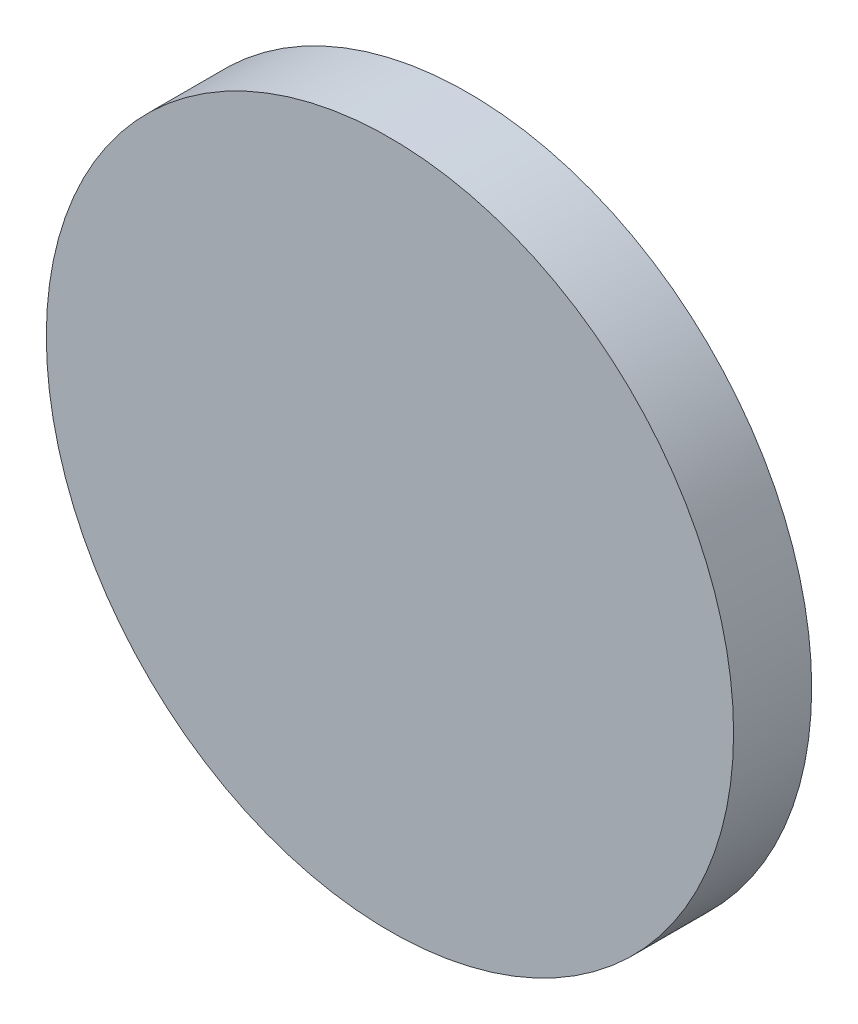
ISO-10303-21;
HEADER;
FILE_DESCRIPTION(('STEP AP214'),'2;1');
FILE_NAME('part.step','',(''),(''),'','','');
FILE_SCHEMA(('AUTOMOTIVE_DESIGN { 1 0 10303 214 1 1 1 1 }'));
ENDSEC;
DATA;
#1=APPLICATION_CONTEXT('core data for automotive mechanical design processes');
#2=APPLICATION_PROTOCOL_DEFINITION('international standard','automotive_design',2000,#1);
#3=PRODUCT_CONTEXT('',#1,'mechanical');
#4=PRODUCT('Part','Part','',(#3));
#5=PRODUCT_RELATED_PRODUCT_CATEGORY('part','',(#4));
#6=PRODUCT_DEFINITION_FORMATION('','',#4);
#7=PRODUCT_DEFINITION_CONTEXT('part definition',#1,'design');
#8=PRODUCT_DEFINITION('design','',#6,#7);
#9=PRODUCT_DEFINITION_SHAPE('','',#8);
#10=(LENGTH_UNIT() NAMED_UNIT(*) SI_UNIT(.MILLI.,.METRE.));
#11=(NAMED_UNIT(*) PLANE_ANGLE_UNIT() SI_UNIT($,.RADIAN.));
#12=(NAMED_UNIT(*) SI_UNIT($,.STERADIAN.) SOLID_ANGLE_UNIT());
#13=UNCERTAINTY_MEASURE_WITH_UNIT(LENGTH_MEASURE(1.E-05),#10,'distance_accuracy_value','');
#14=(GEOMETRIC_REPRESENTATION_CONTEXT(3) GLOBAL_UNCERTAINTY_ASSIGNED_CONTEXT((#13)) GLOBAL_UNIT_ASSIGNED_CONTEXT((#10,
#11,#12)) REPRESENTATION_CONTEXT('',''));
#15=CARTESIAN_POINT('',(0.,0.,0.));
#16=DIRECTION('',(0.,0.,1.));
#17=DIRECTION('',(1.,0.,0.));
#18=AXIS2_PLACEMENT_3D('',#15,#16,#17);
#19=CARTESIAN_POINT('',(0.,0.,0.));
#20=DIRECTION('',(0.,0.,1.));
#21=DIRECTION('',(1.,0.,0.));
#22=AXIS2_PLACEMENT_3D('',#19,#20,#21);
#23=PLANE('',#22);
#24=CARTESIAN_POINT('',(0.,0.,0.));
#25=DIRECTION('',(0.,0.,-1.));
#26=DIRECTION('',(-1.,0.,0.));
#27=AXIS2_PLACEMENT_3D('',#24,#25,#26);
#28=CIRCLE('',#27,22.352);
#29=CARTESIAN_POINT('',(-22.352,0.,0.));
#30=VERTEX_POINT('',#29);
#31=EDGE_CURVE('E17',#30,#30,#28,.F.);
#32=ORIENTED_EDGE('',*,*,#31,.F.);
#33=EDGE_LOOP('',(#32));
#34=FACE_BOUND('',#33,.T.);
#35=ADVANCED_FACE('F14',(#34),#23,.F.);
#36=CARTESIAN_POINT('',(0.,0.,5.08));
#37=DIRECTION('',(0.,0.,-1.));
#38=DIRECTION('',(-1.,0.,0.));
#39=AXIS2_PLACEMENT_3D('',#36,#37,#38);
#40=CYLINDRICAL_SURFACE('',#39,22.352);
#41=ORIENTED_EDGE('',*,*,#31,.T.);
#42=EDGE_LOOP('',(#41));
#43=FACE_BOUND('',#42,.T.);
#44=CARTESIAN_POINT('',(0.,0.,5.08));
#45=DIRECTION('',(0.,0.,-1.));
#46=DIRECTION('',(-1.,0.,0.));
#47=AXIS2_PLACEMENT_3D('',#44,#45,#46);
#48=CIRCLE('',#47,22.352);
#49=CARTESIAN_POINT('',(-22.352,0.,5.08));
#50=VERTEX_POINT('',#49);
#51=EDGE_CURVE('E10',#50,#50,#48,.F.);
#52=ORIENTED_EDGE('',*,*,#51,.F.);
#53=EDGE_LOOP('',(#52));
#54=FACE_BOUND('',#53,.T.);
#55=ADVANCED_FACE('F26',(#43,#54),#40,.T.);
#56=CARTESIAN_POINT('',(0.,0.,5.08));
#57=DIRECTION('',(0.,0.,1.));
#58=DIRECTION('',(1.,0.,0.));
#59=AXIS2_PLACEMENT_3D('',#56,#57,#58);
#60=PLANE('',#59);
#61=ORIENTED_EDGE('',*,*,#51,.T.);
#62=EDGE_LOOP('',(#61));
#63=FACE_BOUND('',#62,.T.);
#64=ADVANCED_FACE('F34',(#63),#60,.T.);
#65=CLOSED_SHELL('',(#35,#55,#64));
#66=MANIFOLD_SOLID_BREP('B1',#65);
#67=ADVANCED_BREP_SHAPE_REPRESENTATION('',(#18,#66),#14);
#68=SHAPE_DEFINITION_REPRESENTATION(#9,#67);
ENDSEC;
END-ISO-10303-21;
